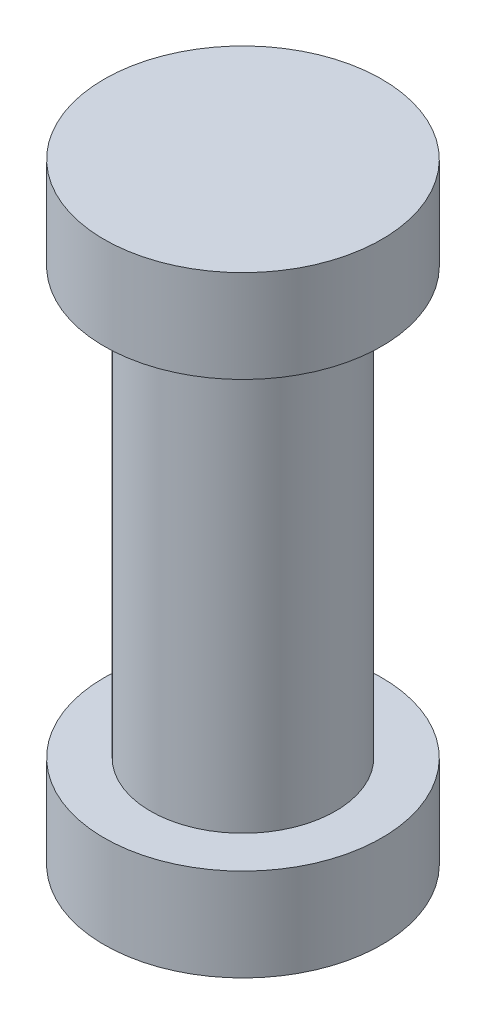
ISO-10303-21;
HEADER;
FILE_DESCRIPTION(('STEP AP214'),'2;1');
FILE_NAME('part.step','',(''),(''),'','','');
FILE_SCHEMA(('AUTOMOTIVE_DESIGN { 1 0 10303 214 1 1 1 1 }'));
ENDSEC;
DATA;
#1=APPLICATION_CONTEXT('core data for automotive mechanical design processes');
#2=APPLICATION_PROTOCOL_DEFINITION('international standard','automotive_design',2000,#1);
#3=PRODUCT_CONTEXT('',#1,'mechanical');
#4=PRODUCT('Part','Part','',(#3));
#5=PRODUCT_RELATED_PRODUCT_CATEGORY('part','',(#4));
#6=PRODUCT_DEFINITION_FORMATION('','',#4);
#7=PRODUCT_DEFINITION_CONTEXT('part definition',#1,'design');
#8=PRODUCT_DEFINITION('design','',#6,#7);
#9=PRODUCT_DEFINITION_SHAPE('','',#8);
#10=(LENGTH_UNIT() NAMED_UNIT(*) SI_UNIT(.MILLI.,.METRE.));
#11=(NAMED_UNIT(*) PLANE_ANGLE_UNIT() SI_UNIT($,.RADIAN.));
#12=(NAMED_UNIT(*) SI_UNIT($,.STERADIAN.) SOLID_ANGLE_UNIT());
#13=UNCERTAINTY_MEASURE_WITH_UNIT(LENGTH_MEASURE(1.E-05),#10,'distance_accuracy_value','');
#14=(GEOMETRIC_REPRESENTATION_CONTEXT(3) GLOBAL_UNCERTAINTY_ASSIGNED_CONTEXT((#13)) GLOBAL_UNIT_ASSIGNED_CONTEXT((#10,
#11,#12)) REPRESENTATION_CONTEXT('',''));
#15=CARTESIAN_POINT('',(0.,0.,0.));
#16=DIRECTION('',(0.,0.,1.));
#17=DIRECTION('',(1.,0.,0.));
#18=AXIS2_PLACEMENT_3D('',#15,#16,#17);
#19=CARTESIAN_POINT('',(0.,0.,0.));
#20=DIRECTION('',(0.,1.,0.));
#21=DIRECTION('',(-1.,0.,0.));
#22=AXIS2_PLACEMENT_3D('',#19,#20,#21);
#23=PLANE('',#22);
#24=CARTESIAN_POINT('',(0.,0.,0.));
#25=DIRECTION('',(0.,1.,0.));
#26=DIRECTION('',(-1.,0.,0.));
#27=AXIS2_PLACEMENT_3D('',#24,#25,#26);
#28=CIRCLE('',#27,9.525);
#29=CARTESIAN_POINT('',(-9.525,0.,0.));
#30=VERTEX_POINT('',#29);
#31=EDGE_CURVE('E10',#30,#30,#28,.T.);
#32=ORIENTED_EDGE('',*,*,#31,.F.);
#33=EDGE_LOOP('',(#32));
#34=FACE_BOUND('',#33,.T.);
#35=ADVANCED_FACE('F33',(#34),#23,.F.);
#36=CARTESIAN_POINT('',(0.,41.91,0.));
#37=DIRECTION('',(0.,1.,0.));
#38=DIRECTION('',(-1.,0.,0.));
#39=AXIS2_PLACEMENT_3D('',#36,#37,#38);
#40=CYLINDRICAL_SURFACE('',#39,9.525);
#41=CARTESIAN_POINT('',(0.,6.35,0.));
#42=DIRECTION('',(0.,1.,0.));
#43=DIRECTION('',(-1.,0.,0.));
#44=AXIS2_PLACEMENT_3D('',#41,#42,#43);
#45=CIRCLE('',#44,9.525);
#46=CARTESIAN_POINT('',(-9.525,6.35,0.));
#47=VERTEX_POINT('',#46);
#48=EDGE_CURVE('E39',#47,#47,#45,.T.);
#49=ORIENTED_EDGE('',*,*,#48,.F.);
#50=EDGE_LOOP('',(#49));
#51=FACE_BOUND('',#50,.T.);
#52=ORIENTED_EDGE('',*,*,#31,.T.);
#53=EDGE_LOOP('',(#52));
#54=FACE_BOUND('',#53,.T.);
#55=ADVANCED_FACE('F81',(#51,#54),#40,.T.);
#56=CARTESIAN_POINT('',(9.525,6.35,0.));
#57=DIRECTION('',(0.,-1.,0.));
#58=DIRECTION('',(1.,0.,0.));
#59=AXIS2_PLACEMENT_3D('',#56,#57,#58);
#60=PLANE('',#59);
#61=CARTESIAN_POINT('',(0.,6.35,0.));
#62=DIRECTION('',(0.,1.,0.));
#63=DIRECTION('',(-1.,0.,0.));
#64=AXIS2_PLACEMENT_3D('',#61,#62,#63);
#65=CIRCLE('',#64,6.346825);
#66=CARTESIAN_POINT('',(-6.346825,6.35,0.));
#67=VERTEX_POINT('',#66);
#68=EDGE_CURVE('E43',#67,#67,#65,.T.);
#69=ORIENTED_EDGE('',*,*,#68,.F.);
#70=EDGE_LOOP('',(#69));
#71=FACE_BOUND('',#70,.T.);
#72=ORIENTED_EDGE('',*,*,#48,.T.);
#73=EDGE_LOOP('',(#72));
#74=FACE_BOUND('',#73,.T.);
#75=ADVANCED_FACE('F76',(#71,#74),#60,.F.);
#76=CARTESIAN_POINT('',(0.,41.91,0.));
#77=DIRECTION('',(0.,1.,0.));
#78=DIRECTION('',(-1.,0.,0.));
#79=AXIS2_PLACEMENT_3D('',#76,#77,#78);
#80=CYLINDRICAL_SURFACE('',#79,6.346825);
#81=CARTESIAN_POINT('',(0.,35.56,0.));
#82=DIRECTION('',(0.,1.,0.));
#83=DIRECTION('',(-1.,0.,0.));
#84=AXIS2_PLACEMENT_3D('',#81,#82,#83);
#85=CIRCLE('',#84,6.346825);
#86=CARTESIAN_POINT('',(-6.346825,35.56,0.));
#87=VERTEX_POINT('',#86);
#88=EDGE_CURVE('E47',#87,#87,#85,.T.);
#89=ORIENTED_EDGE('',*,*,#88,.F.);
#90=EDGE_LOOP('',(#89));
#91=FACE_BOUND('',#90,.T.);
#92=ORIENTED_EDGE('',*,*,#68,.T.);
#93=EDGE_LOOP('',(#92));
#94=FACE_BOUND('',#93,.T.);
#95=ADVANCED_FACE('F70',(#91,#94),#80,.T.);
#96=CARTESIAN_POINT('',(6.346825,35.56,0.));
#97=DIRECTION('',(0.,1.,0.));
#98=DIRECTION('',(-1.,0.,0.));
#99=AXIS2_PLACEMENT_3D('',#96,#97,#98);
#100=PLANE('',#99);
#101=CARTESIAN_POINT('',(0.,35.56,0.));
#102=DIRECTION('',(0.,1.,0.));
#103=DIRECTION('',(-1.,0.,0.));
#104=AXIS2_PLACEMENT_3D('',#101,#102,#103);
#105=CIRCLE('',#104,9.525);
#106=CARTESIAN_POINT('',(-9.525,35.56,0.));
#107=VERTEX_POINT('',#106);
#108=EDGE_CURVE('E52',#107,#107,#105,.T.);
#109=ORIENTED_EDGE('',*,*,#108,.F.);
#110=EDGE_LOOP('',(#109));
#111=FACE_BOUND('',#110,.T.);
#112=ORIENTED_EDGE('',*,*,#88,.T.);
#113=EDGE_LOOP('',(#112));
#114=FACE_BOUND('',#113,.T.);
#115=ADVANCED_FACE('F64',(#111,#114),#100,.F.);
#116=CARTESIAN_POINT('',(0.,41.91,0.));
#117=DIRECTION('',(0.,1.,0.));
#118=DIRECTION('',(-1.,0.,0.));
#119=AXIS2_PLACEMENT_3D('',#116,#117,#118);
#120=CYLINDRICAL_SURFACE('',#119,9.525);
#121=CARTESIAN_POINT('',(0.,41.91,0.));
#122=DIRECTION('',(0.,1.,0.));
#123=DIRECTION('',(-1.,0.,0.));
#124=AXIS2_PLACEMENT_3D('',#121,#122,#123);
#125=CIRCLE('',#124,9.525);
#126=CARTESIAN_POINT('',(-9.525,41.91,0.));
#127=VERTEX_POINT('',#126);
#128=EDGE_CURVE('E55',#127,#127,#125,.T.);
#129=ORIENTED_EDGE('',*,*,#128,.F.);
#130=EDGE_LOOP('',(#129));
#131=FACE_BOUND('',#130,.T.);
#132=ORIENTED_EDGE('',*,*,#108,.T.);
#133=EDGE_LOOP('',(#132));
#134=FACE_BOUND('',#133,.T.);
#135=ADVANCED_FACE('F61',(#131,#134),#120,.T.);
#136=CARTESIAN_POINT('',(9.525,41.91,0.));
#137=DIRECTION('',(0.,-1.,0.));
#138=DIRECTION('',(1.,0.,0.));
#139=AXIS2_PLACEMENT_3D('',#136,#137,#138);
#140=PLANE('',#139);
#141=ORIENTED_EDGE('',*,*,#128,.T.);
#142=EDGE_LOOP('',(#141));
#143=FACE_BOUND('',#142,.T.);
#144=ADVANCED_FACE('F59',(#143),#140,.F.);
#145=CLOSED_SHELL('',(#35,#55,#75,#95,#115,#135,#144));
#146=MANIFOLD_SOLID_BREP('B2',#145);
#147=ADVANCED_BREP_SHAPE_REPRESENTATION('',(#18,#146),#14);
#148=SHAPE_DEFINITION_REPRESENTATION(#9,#147);
ENDSEC;
END-ISO-10303-21;
